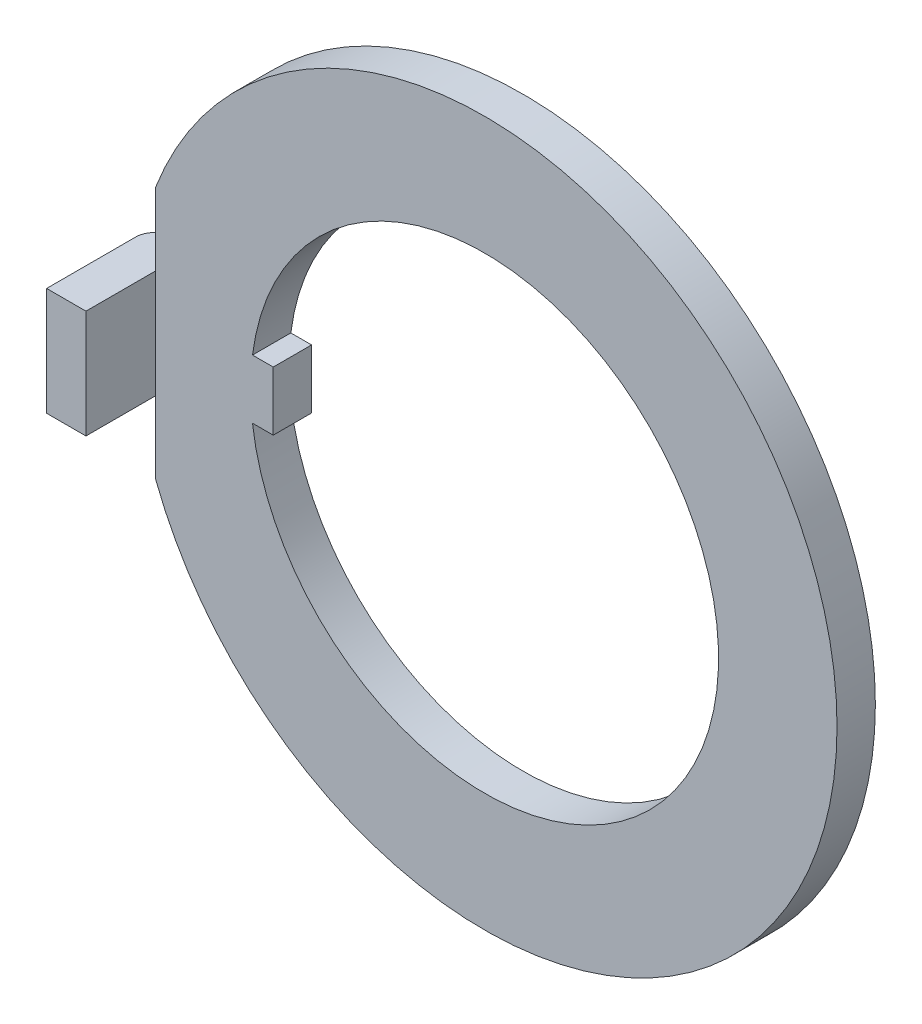
ISO-10303-21;
HEADER;
FILE_DESCRIPTION(('STEP AP214'),'2;1');
FILE_NAME('part.step','',(''),(''),'','','');
FILE_SCHEMA(('AUTOMOTIVE_DESIGN { 1 0 10303 214 1 1 1 1 }'));
ENDSEC;
DATA;
#1=APPLICATION_CONTEXT('core data for automotive mechanical design processes');
#2=APPLICATION_PROTOCOL_DEFINITION('international standard','automotive_design',2000,#1);
#3=PRODUCT_CONTEXT('',#1,'mechanical');
#4=PRODUCT('Part','Part','',(#3));
#5=PRODUCT_RELATED_PRODUCT_CATEGORY('part','',(#4));
#6=PRODUCT_DEFINITION_FORMATION('','',#4);
#7=PRODUCT_DEFINITION_CONTEXT('part definition',#1,'design');
#8=PRODUCT_DEFINITION('design','',#6,#7);
#9=PRODUCT_DEFINITION_SHAPE('','',#8);
#10=(LENGTH_UNIT() NAMED_UNIT(*) SI_UNIT(.MILLI.,.METRE.));
#11=(NAMED_UNIT(*) PLANE_ANGLE_UNIT() SI_UNIT($,.RADIAN.));
#12=(NAMED_UNIT(*) SI_UNIT($,.STERADIAN.) SOLID_ANGLE_UNIT());
#13=UNCERTAINTY_MEASURE_WITH_UNIT(LENGTH_MEASURE(1.E-05),#10,'distance_accuracy_value','');
#14=(GEOMETRIC_REPRESENTATION_CONTEXT(3) GLOBAL_UNCERTAINTY_ASSIGNED_CONTEXT((#13)) GLOBAL_UNIT_ASSIGNED_CONTEXT((#10,
#11,#12)) REPRESENTATION_CONTEXT('',''));
#15=CARTESIAN_POINT('',(0.,0.,0.));
#16=DIRECTION('',(0.,0.,1.));
#17=DIRECTION('',(1.,0.,0.));
#18=AXIS2_PLACEMENT_3D('',#15,#16,#17);
#19=CARTESIAN_POINT('',(-8.4963,3.27571383365519,0.9906));
#20=DIRECTION('',(1.,0.,0.));
#21=DIRECTION('',(0.,0.,-1.));
#22=AXIS2_PLACEMENT_3D('',#19,#20,#21);
#23=PLANE('',#22);
#24=DIRECTION('',(0.,-1.,0.));
#25=VECTOR('',#24,1.);
#26=CARTESIAN_POINT('',(-8.4963,3.27571383365519,0.));
#27=LINE('',#26,#25);
#28=CARTESIAN_POINT('',(-8.4963,3.27571383365519,0.));
#29=VERTEX_POINT('',#28);
#30=CARTESIAN_POINT('',(-8.4963,1.397,0.));
#31=VERTEX_POINT('',#30);
#32=EDGE_CURVE('E11',#29,#31,#27,.T.);
#33=ORIENTED_EDGE('',*,*,#32,.T.);
#34=DIRECTION('',(0.,0.,1.));
#35=VECTOR('',#34,1.);
#36=CARTESIAN_POINT('',(-8.4963,1.397,0.9906));
#37=LINE('',#36,#35);
#38=CARTESIAN_POINT('',(-8.4963,1.397,0.9906));
#39=VERTEX_POINT('',#38);
#40=EDGE_CURVE('E25',#31,#39,#37,.T.);
#41=ORIENTED_EDGE('',*,*,#40,.T.);
#42=DIRECTION('',(0.,-1.,0.));
#43=VECTOR('',#42,1.);
#44=CARTESIAN_POINT('',(-8.4963,3.27571383365519,0.9906));
#45=LINE('',#44,#43);
#46=CARTESIAN_POINT('',(-8.4963,3.27571383365519,0.9906));
#47=VERTEX_POINT('',#46);
#48=EDGE_CURVE('E271',#47,#39,#45,.T.);
#49=ORIENTED_EDGE('',*,*,#48,.F.);
#50=DIRECTION('',(0.,0.,-1.));
#51=VECTOR('',#50,1.);
#52=CARTESIAN_POINT('',(-8.4963,3.27571383365519,0.9906));
#53=LINE('',#52,#51);
#54=EDGE_CURVE('E267',#47,#29,#53,.T.);
#55=ORIENTED_EDGE('',*,*,#54,.T.);
#56=EDGE_LOOP('',(#33,#41,#49,#55));
#57=FACE_BOUND('',#56,.T.);
#58=ADVANCED_FACE('F17',(#57),#23,.F.);
#59=CARTESIAN_POINT('',(0.,0.,0.9906));
#60=DIRECTION('',(0.,0.,1.));
#61=DIRECTION('',(-1.,0.,0.));
#62=AXIS2_PLACEMENT_3D('',#59,#60,#61);
#63=CYLINDRICAL_SURFACE('',#62,9.1059);
#64=CARTESIAN_POINT('',(0.,0.,0.));
#65=DIRECTION('',(0.,0.,1.));
#66=DIRECTION('',(1.,0.,0.));
#67=AXIS2_PLACEMENT_3D('',#64,#65,#66);
#68=CIRCLE('',#67,9.1059);
#69=CARTESIAN_POINT('',(-8.4963,-3.27571383365519,0.));
#70=VERTEX_POINT('',#69);
#71=EDGE_CURVE('E262',#70,#29,#68,.T.);
#72=ORIENTED_EDGE('',*,*,#71,.T.);
#73=ORIENTED_EDGE('',*,*,#54,.F.);
#74=CARTESIAN_POINT('',(0.,0.,0.9906));
#75=DIRECTION('',(0.,0.,1.));
#76=DIRECTION('',(1.,0.,0.));
#77=AXIS2_PLACEMENT_3D('',#74,#75,#76);
#78=CIRCLE('',#77,9.1059);
#79=CARTESIAN_POINT('',(-8.4963,-3.27571383365519,0.9906));
#80=VERTEX_POINT('',#79);
#81=EDGE_CURVE('E257',#80,#47,#78,.T.);
#82=ORIENTED_EDGE('',*,*,#81,.F.);
#83=DIRECTION('',(0.,0.,-1.));
#84=VECTOR('',#83,1.);
#85=CARTESIAN_POINT('',(-8.4963,-3.27571383365519,0.9906));
#86=LINE('',#85,#84);
#87=EDGE_CURVE('E253',#80,#70,#86,.T.);
#88=ORIENTED_EDGE('',*,*,#87,.T.);
#89=EDGE_LOOP('',(#72,#73,#82,#88));
#90=FACE_BOUND('',#89,.T.);
#91=ADVANCED_FACE('F300',(#90),#63,.T.);
#92=CARTESIAN_POINT('',(-8.4963,3.27571383365519,0.9906));
#93=DIRECTION('',(1.,0.,0.));
#94=DIRECTION('',(0.,0.,-1.));
#95=AXIS2_PLACEMENT_3D('',#92,#93,#94);
#96=PLANE('',#95);
#97=DIRECTION('',(0.,0.,1.));
#98=VECTOR('',#97,1.);
#99=CARTESIAN_POINT('',(-8.4963,-1.397,0.9906));
#100=LINE('',#99,#98);
#101=CARTESIAN_POINT('',(-8.4963,-1.397,0.));
#102=VERTEX_POINT('',#101);
#103=CARTESIAN_POINT('',(-8.4963,-1.397,0.9906));
#104=VERTEX_POINT('',#103);
#105=EDGE_CURVE('E248',#102,#104,#100,.T.);
#106=ORIENTED_EDGE('',*,*,#105,.F.);
#107=DIRECTION('',(0.,-1.,0.));
#108=VECTOR('',#107,1.);
#109=CARTESIAN_POINT('',(-8.4963,3.27571383365519,0.));
#110=LINE('',#109,#108);
#111=EDGE_CURVE('E243',#102,#70,#110,.T.);
#112=ORIENTED_EDGE('',*,*,#111,.T.);
#113=ORIENTED_EDGE('',*,*,#87,.F.);
#114=DIRECTION('',(0.,-1.,0.));
#115=VECTOR('',#114,1.);
#116=CARTESIAN_POINT('',(-8.4963,3.27571383365519,0.9906));
#117=LINE('',#116,#115);
#118=EDGE_CURVE('E238',#104,#80,#117,.T.);
#119=ORIENTED_EDGE('',*,*,#118,.F.);
#120=EDGE_LOOP('',(#106,#112,#113,#119));
#121=FACE_BOUND('',#120,.T.);
#122=ADVANCED_FACE('F293',(#121),#96,.F.);
#123=CARTESIAN_POINT('',(0.,0.,0.9906));
#124=DIRECTION('',(0.,0.,1.));
#125=DIRECTION('',(1.,0.,0.));
#126=AXIS2_PLACEMENT_3D('',#123,#124,#125);
#127=PLANE('',#126);
#128=ORIENTED_EDGE('',*,*,#48,.T.);
#129=DIRECTION('',(0.,-1.,0.));
#130=VECTOR('',#129,1.);
#131=CARTESIAN_POINT('',(-8.4963,1.397,0.9906));
#132=LINE('',#131,#130);
#133=EDGE_CURVE('E233',#39,#104,#132,.T.);
#134=ORIENTED_EDGE('',*,*,#133,.T.);
#135=ORIENTED_EDGE('',*,*,#118,.T.);
#136=ORIENTED_EDGE('',*,*,#81,.T.);
#137=EDGE_LOOP('',(#128,#134,#135,#136));
#138=FACE_BOUND('',#137,.T.);
#139=DIRECTION('',(-1.,0.,0.));
#140=VECTOR('',#139,1.);
#141=CARTESIAN_POINT('',(-5.461,-0.762,0.9906));
#142=LINE('',#141,#140);
#143=CARTESIAN_POINT('',(-5.461,-0.762,0.9906));
#144=VERTEX_POINT('',#143);
#145=CARTESIAN_POINT('',(-5.99698249455509,-0.761999999999995,0.9906));
#146=VERTEX_POINT('',#145);
#147=EDGE_CURVE('E228',#144,#146,#142,.T.);
#148=ORIENTED_EDGE('',*,*,#147,.F.);
#149=DIRECTION('',(0.,-1.,0.));
#150=VECTOR('',#149,1.);
#151=CARTESIAN_POINT('',(-5.461,0.762,0.9906));
#152=LINE('',#151,#150);
#153=CARTESIAN_POINT('',(-5.461,0.762,0.9906));
#154=VERTEX_POINT('',#153);
#155=EDGE_CURVE('E223',#154,#144,#152,.T.);
#156=ORIENTED_EDGE('',*,*,#155,.F.);
#157=DIRECTION('',(1.,0.,0.));
#158=VECTOR('',#157,1.);
#159=CARTESIAN_POINT('',(-5.99698249455509,0.762,0.9906));
#160=LINE('',#159,#158);
#161=CARTESIAN_POINT('',(-5.99698249455509,0.761999999999992,0.9906));
#162=VERTEX_POINT('',#161);
#163=EDGE_CURVE('E218',#162,#154,#160,.T.);
#164=ORIENTED_EDGE('',*,*,#163,.F.);
#165=CARTESIAN_POINT('',(0.,0.,0.9906));
#166=DIRECTION('',(0.,0.,1.));
#167=DIRECTION('',(1.,0.,0.));
#168=AXIS2_PLACEMENT_3D('',#165,#166,#167);
#169=CIRCLE('',#168,6.0452);
#170=EDGE_CURVE('E213',#146,#162,#169,.T.);
#171=ORIENTED_EDGE('',*,*,#170,.F.);
#172=EDGE_LOOP('',(#148,#156,#164,#171));
#173=FACE_BOUND('',#172,.T.);
#174=ADVANCED_FACE('F280',(#138,#173),#127,.T.);
#175=CARTESIAN_POINT('',(0.,0.,0.9906));
#176=DIRECTION('',(0.,0.,1.));
#177=DIRECTION('',(-1.,0.,0.));
#178=AXIS2_PLACEMENT_3D('',#175,#176,#177);
#179=CYLINDRICAL_SURFACE('',#178,6.0452);
#180=DIRECTION('',(0.,0.,-1.));
#181=VECTOR('',#180,1.);
#182=CARTESIAN_POINT('',(-5.99698249455509,0.761999999999992,0.9906));
#183=LINE('',#182,#181);
#184=CARTESIAN_POINT('',(-5.99698249455509,0.761999999999992,0.));
#185=VERTEX_POINT('',#184);
#186=EDGE_CURVE('E209',#162,#185,#183,.T.);
#187=ORIENTED_EDGE('',*,*,#186,.T.);
#188=CARTESIAN_POINT('',(0.,0.,0.));
#189=DIRECTION('',(0.,0.,1.));
#190=DIRECTION('',(1.,0.,0.));
#191=AXIS2_PLACEMENT_3D('',#188,#189,#190);
#192=CIRCLE('',#191,6.0452);
#193=CARTESIAN_POINT('',(-5.99698249455509,-0.761999999999995,0.));
#194=VERTEX_POINT('',#193);
#195=EDGE_CURVE('E204',#194,#185,#192,.T.);
#196=ORIENTED_EDGE('',*,*,#195,.F.);
#197=DIRECTION('',(0.,0.,-1.));
#198=VECTOR('',#197,1.);
#199=CARTESIAN_POINT('',(-5.99698249455509,-0.761999999999995,0.9906));
#200=LINE('',#199,#198);
#201=EDGE_CURVE('E199',#146,#194,#200,.T.);
#202=ORIENTED_EDGE('',*,*,#201,.F.);
#203=ORIENTED_EDGE('',*,*,#170,.T.);
#204=EDGE_LOOP('',(#187,#196,#202,#203));
#205=FACE_BOUND('',#204,.T.);
#206=ADVANCED_FACE('F313',(#205),#179,.F.);
#207=CARTESIAN_POINT('',(-5.461,-0.762,0.9906));
#208=DIRECTION('',(0.,-1.,0.));
#209=DIRECTION('',(0.,0.,-1.));
#210=AXIS2_PLACEMENT_3D('',#207,#208,#209);
#211=PLANE('',#210);
#212=DIRECTION('',(-1.,0.,0.));
#213=VECTOR('',#212,1.);
#214=CARTESIAN_POINT('',(-5.461,-0.762,0.));
#215=LINE('',#214,#213);
#216=CARTESIAN_POINT('',(-5.461,-0.762,0.));
#217=VERTEX_POINT('',#216);
#218=EDGE_CURVE('E194',#217,#194,#215,.T.);
#219=ORIENTED_EDGE('',*,*,#218,.F.);
#220=DIRECTION('',(0.,0.,-1.));
#221=VECTOR('',#220,1.);
#222=CARTESIAN_POINT('',(-5.461,-0.762,0.9906));
#223=LINE('',#222,#221);
#224=EDGE_CURVE('E189',#144,#217,#223,.T.);
#225=ORIENTED_EDGE('',*,*,#224,.F.);
#226=ORIENTED_EDGE('',*,*,#147,.T.);
#227=ORIENTED_EDGE('',*,*,#201,.T.);
#228=EDGE_LOOP('',(#219,#225,#226,#227));
#229=FACE_BOUND('',#228,.T.);
#230=ADVANCED_FACE('F316',(#229),#211,.T.);
#231=CARTESIAN_POINT('',(-5.461,0.762,0.9906));
#232=DIRECTION('',(1.,0.,0.));
#233=DIRECTION('',(0.,0.,-1.));
#234=AXIS2_PLACEMENT_3D('',#231,#232,#233);
#235=PLANE('',#234);
#236=DIRECTION('',(0.,-1.,0.));
#237=VECTOR('',#236,1.);
#238=CARTESIAN_POINT('',(-5.461,0.762,0.));
#239=LINE('',#238,#237);
#240=CARTESIAN_POINT('',(-5.461,0.762,0.));
#241=VERTEX_POINT('',#240);
#242=EDGE_CURVE('E184',#241,#217,#239,.T.);
#243=ORIENTED_EDGE('',*,*,#242,.F.);
#244=DIRECTION('',(0.,0.,-1.));
#245=VECTOR('',#244,1.);
#246=CARTESIAN_POINT('',(-5.461,0.762,0.9906));
#247=LINE('',#246,#245);
#248=EDGE_CURVE('E179',#154,#241,#247,.T.);
#249=ORIENTED_EDGE('',*,*,#248,.F.);
#250=ORIENTED_EDGE('',*,*,#155,.T.);
#251=ORIENTED_EDGE('',*,*,#224,.T.);
#252=EDGE_LOOP('',(#243,#249,#250,#251));
#253=FACE_BOUND('',#252,.T.);
#254=ADVANCED_FACE('F320',(#253),#235,.T.);
#255=CARTESIAN_POINT('',(-5.99698249455509,0.762,0.9906));
#256=DIRECTION('',(0.,1.,0.));
#257=DIRECTION('',(0.,0.,1.));
#258=AXIS2_PLACEMENT_3D('',#255,#256,#257);
#259=PLANE('',#258);
#260=DIRECTION('',(1.,0.,0.));
#261=VECTOR('',#260,1.);
#262=CARTESIAN_POINT('',(-5.99698249455509,0.762,0.));
#263=LINE('',#262,#261);
#264=EDGE_CURVE('E174',#185,#241,#263,.T.);
#265=ORIENTED_EDGE('',*,*,#264,.F.);
#266=ORIENTED_EDGE('',*,*,#186,.F.);
#267=ORIENTED_EDGE('',*,*,#163,.T.);
#268=ORIENTED_EDGE('',*,*,#248,.T.);
#269=EDGE_LOOP('',(#265,#266,#267,#268));
#270=FACE_BOUND('',#269,.T.);
#271=ADVANCED_FACE('F324',(#270),#259,.T.);
#272=CARTESIAN_POINT('',(0.,0.,0.));
#273=DIRECTION('',(0.,0.,1.));
#274=DIRECTION('',(1.,0.,0.));
#275=AXIS2_PLACEMENT_3D('',#272,#273,#274);
#276=PLANE('',#275);
#277=ORIENTED_EDGE('',*,*,#111,.F.);
#278=DIRECTION('',(-1.,0.,0.));
#279=VECTOR('',#278,1.);
#280=CARTESIAN_POINT('',(-6.0833,-1.397,0.));
#281=LINE('',#280,#279);
#282=CARTESIAN_POINT('',(-9.017,-1.397,0.));
#283=VERTEX_POINT('',#282);
#284=EDGE_CURVE('E170',#102,#283,#281,.T.);
#285=ORIENTED_EDGE('',*,*,#284,.T.);
#286=DIRECTION('',(0.,-1.,0.));
#287=VECTOR('',#286,1.);
#288=CARTESIAN_POINT('',(-9.017,1.397,0.));
#289=LINE('',#288,#287);
#290=CARTESIAN_POINT('',(-9.017,1.397,0.));
#291=VERTEX_POINT('',#290);
#292=EDGE_CURVE('E118',#291,#283,#289,.T.);
#293=ORIENTED_EDGE('',*,*,#292,.F.);
#294=DIRECTION('',(-1.,0.,0.));
#295=VECTOR('',#294,1.);
#296=CARTESIAN_POINT('',(-6.0833,1.397,0.));
#297=LINE('',#296,#295);
#298=EDGE_CURVE('E162',#31,#291,#297,.T.);
#299=ORIENTED_EDGE('',*,*,#298,.F.);
#300=ORIENTED_EDGE('',*,*,#32,.F.);
#301=ORIENTED_EDGE('',*,*,#71,.F.);
#302=EDGE_LOOP('',(#277,#285,#293,#299,#300,#301));
#303=FACE_BOUND('',#302,.T.);
#304=ORIENTED_EDGE('',*,*,#218,.T.);
#305=ORIENTED_EDGE('',*,*,#195,.T.);
#306=ORIENTED_EDGE('',*,*,#264,.T.);
#307=ORIENTED_EDGE('',*,*,#242,.T.);
#308=EDGE_LOOP('',(#304,#305,#306,#307));
#309=FACE_BOUND('',#308,.T.);
#310=ADVANCED_FACE('F297',(#303,#309),#276,.F.);
#311=CARTESIAN_POINT('',(-9.017,1.397,0.49529999999999));
#312=DIRECTION('',(0.,1.,0.));
#313=DIRECTION('',(0.,0.,1.));
#314=AXIS2_PLACEMENT_3D('',#311,#312,#313);
#315=PLANE('',#314);
#316=ORIENTED_EDGE('',*,*,#40,.F.);
#317=ORIENTED_EDGE('',*,*,#298,.T.);
#318=CARTESIAN_POINT('',(-9.017,1.397,0.49529999999999));
#319=DIRECTION('',(0.,1.,0.));
#320=DIRECTION('',(1.,0.,0.));
#321=AXIS2_PLACEMENT_3D('',#318,#319,#320);
#322=CIRCLE('',#321,0.4953);
#323=CARTESIAN_POINT('',(-9.5123,1.397,0.4953));
#324=VERTEX_POINT('',#323);
#325=EDGE_CURVE('E158',#291,#324,#322,.T.);
#326=ORIENTED_EDGE('',*,*,#325,.T.);
#327=DIRECTION('',(0.,0.,1.));
#328=VECTOR('',#327,1.);
#329=CARTESIAN_POINT('',(-9.5123,1.397,0.4953));
#330=LINE('',#329,#328);
#331=CARTESIAN_POINT('',(-9.5123,1.397,2.794));
#332=VERTEX_POINT('',#331);
#333=EDGE_CURVE('E110',#324,#332,#330,.T.);
#334=ORIENTED_EDGE('',*,*,#333,.T.);
#335=DIRECTION('',(1.,0.,0.));
#336=VECTOR('',#335,1.);
#337=CARTESIAN_POINT('',(-9.5123,1.397,2.794));
#338=LINE('',#337,#336);
#339=CARTESIAN_POINT('',(-8.4963,1.397,2.794));
#340=VERTEX_POINT('',#339);
#341=EDGE_CURVE('E151',#332,#340,#338,.T.);
#342=ORIENTED_EDGE('',*,*,#341,.T.);
#343=DIRECTION('',(0.,0.,-1.));
#344=VECTOR('',#343,1.);
#345=CARTESIAN_POINT('',(-8.4963,1.397,2.794));
#346=LINE('',#345,#344);
#347=EDGE_CURVE('E146',#340,#39,#346,.T.);
#348=ORIENTED_EDGE('',*,*,#347,.T.);
#349=EDGE_LOOP('',(#316,#317,#326,#334,#342,#348));
#350=FACE_BOUND('',#349,.T.);
#351=ADVANCED_FACE('F286',(#350),#315,.T.);
#352=CARTESIAN_POINT('',(-8.4963,1.397,2.794));
#353=DIRECTION('',(-1.,0.,0.));
#354=DIRECTION('',(0.,0.,1.));
#355=AXIS2_PLACEMENT_3D('',#352,#353,#354);
#356=PLANE('',#355);
#357=DIRECTION('',(0.,0.,-1.));
#358=VECTOR('',#357,1.);
#359=CARTESIAN_POINT('',(-8.4963,-1.397,2.794));
#360=LINE('',#359,#358);
#361=CARTESIAN_POINT('',(-8.4963,-1.397,2.794));
#362=VERTEX_POINT('',#361);
#363=EDGE_CURVE('E141',#362,#104,#360,.T.);
#364=ORIENTED_EDGE('',*,*,#363,.T.);
#365=ORIENTED_EDGE('',*,*,#133,.F.);
#366=ORIENTED_EDGE('',*,*,#347,.F.);
#367=DIRECTION('',(0.,-1.,0.));
#368=VECTOR('',#367,1.);
#369=CARTESIAN_POINT('',(-8.4963,1.397,2.794));
#370=LINE('',#369,#368);
#371=EDGE_CURVE('E137',#340,#362,#370,.T.);
#372=ORIENTED_EDGE('',*,*,#371,.T.);
#373=EDGE_LOOP('',(#364,#365,#366,#372));
#374=FACE_BOUND('',#373,.T.);
#375=ADVANCED_FACE('F290',(#374),#356,.F.);
#376=CARTESIAN_POINT('',(-9.5123,1.397,2.794));
#377=DIRECTION('',(0.,0.,-1.));
#378=DIRECTION('',(-1.,0.,0.));
#379=AXIS2_PLACEMENT_3D('',#376,#377,#378);
#380=PLANE('',#379);
#381=DIRECTION('',(1.,0.,0.));
#382=VECTOR('',#381,1.);
#383=CARTESIAN_POINT('',(-9.5123,-1.397,2.794));
#384=LINE('',#383,#382);
#385=CARTESIAN_POINT('',(-9.5123,-1.397,2.794));
#386=VERTEX_POINT('',#385);
#387=EDGE_CURVE('E125',#386,#362,#384,.T.);
#388=ORIENTED_EDGE('',*,*,#387,.T.);
#389=ORIENTED_EDGE('',*,*,#371,.F.);
#390=ORIENTED_EDGE('',*,*,#341,.F.);
#391=DIRECTION('',(0.,-1.,0.));
#392=VECTOR('',#391,1.);
#393=CARTESIAN_POINT('',(-9.5123,1.397,2.794));
#394=LINE('',#393,#392);
#395=EDGE_CURVE('E126',#332,#386,#394,.T.);
#396=ORIENTED_EDGE('',*,*,#395,.T.);
#397=EDGE_LOOP('',(#388,#389,#390,#396));
#398=FACE_BOUND('',#397,.T.);
#399=ADVANCED_FACE('F335',(#398),#380,.F.);
#400=CARTESIAN_POINT('',(-9.5123,1.397,0.4953));
#401=DIRECTION('',(1.,0.,0.));
#402=DIRECTION('',(0.,0.,-1.));
#403=AXIS2_PLACEMENT_3D('',#400,#401,#402);
#404=PLANE('',#403);
#405=DIRECTION('',(0.,0.,1.));
#406=VECTOR('',#405,1.);
#407=CARTESIAN_POINT('',(-9.5123,-1.397,0.4953));
#408=LINE('',#407,#406);
#409=CARTESIAN_POINT('',(-9.5123,-1.397,0.4953));
#410=VERTEX_POINT('',#409);
#411=EDGE_CURVE('E108',#410,#386,#408,.T.);
#412=ORIENTED_EDGE('',*,*,#411,.T.);
#413=ORIENTED_EDGE('',*,*,#395,.F.);
#414=ORIENTED_EDGE('',*,*,#333,.F.);
#415=DIRECTION('',(0.,-1.,0.));
#416=VECTOR('',#415,1.);
#417=CARTESIAN_POINT('',(-9.5123,1.397,0.4953));
#418=LINE('',#417,#416);
#419=EDGE_CURVE('E103',#324,#410,#418,.T.);
#420=ORIENTED_EDGE('',*,*,#419,.T.);
#421=EDGE_LOOP('',(#412,#413,#414,#420));
#422=FACE_BOUND('',#421,.T.);
#423=ADVANCED_FACE('F105',(#422),#404,.F.);
#424=CARTESIAN_POINT('',(-9.017,1.397,0.49529999999999));
#425=DIRECTION('',(0.,1.,0.));
#426=DIRECTION('',(0.707106781186555,0.,0.70710678118654));
#427=AXIS2_PLACEMENT_3D('',#424,#425,#426);
#428=CYLINDRICAL_SURFACE('',#427,0.4953);
#429=CARTESIAN_POINT('',(-9.017,-1.397,0.49529999999999));
#430=DIRECTION('',(0.,1.,0.));
#431=DIRECTION('',(1.,0.,0.));
#432=AXIS2_PLACEMENT_3D('',#429,#430,#431);
#433=CIRCLE('',#432,0.4953);
#434=EDGE_CURVE('E113',#283,#410,#433,.T.);
#435=ORIENTED_EDGE('',*,*,#434,.T.);
#436=ORIENTED_EDGE('',*,*,#419,.F.);
#437=ORIENTED_EDGE('',*,*,#325,.F.);
#438=ORIENTED_EDGE('',*,*,#292,.T.);
#439=EDGE_LOOP('',(#435,#436,#437,#438));
#440=FACE_BOUND('',#439,.T.);
#441=ADVANCED_FACE('F117',(#440),#428,.T.);
#442=CARTESIAN_POINT('',(-9.017,-1.397,0.49529999999999));
#443=DIRECTION('',(0.,1.,0.));
#444=DIRECTION('',(0.,0.,1.));
#445=AXIS2_PLACEMENT_3D('',#442,#443,#444);
#446=PLANE('',#445);
#447=ORIENTED_EDGE('',*,*,#284,.F.);
#448=ORIENTED_EDGE('',*,*,#105,.T.);
#449=ORIENTED_EDGE('',*,*,#363,.F.);
#450=ORIENTED_EDGE('',*,*,#387,.F.);
#451=ORIENTED_EDGE('',*,*,#411,.F.);
#452=ORIENTED_EDGE('',*,*,#434,.F.);
#453=EDGE_LOOP('',(#447,#448,#449,#450,#451,#452));
#454=FACE_BOUND('',#453,.T.);
#455=ADVANCED_FACE('F122',(#454),#446,.F.);
#456=CLOSED_SHELL('',(#58,#91,#122,#174,#206,#230,#254,#271,#310,#351,#375,#399,#423,#441,#455));
#457=MANIFOLD_SOLID_BREP('B1',#456);
#458=ADVANCED_BREP_SHAPE_REPRESENTATION('',(#18,#457),#14);
#459=SHAPE_DEFINITION_REPRESENTATION(#9,#458);
ENDSEC;
END-ISO-10303-21;
